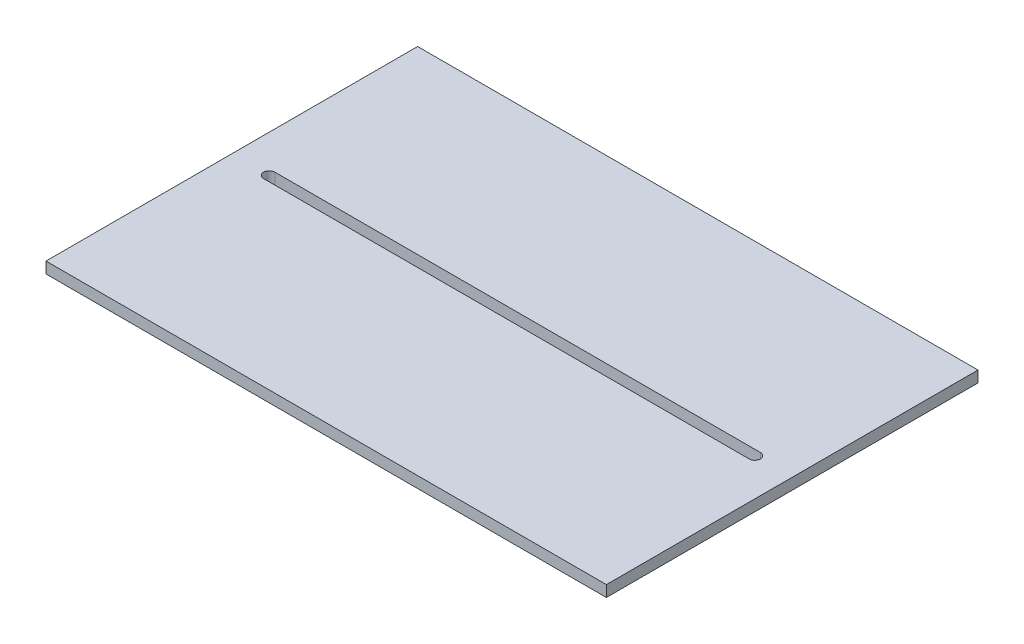
ISO-10303-21;
HEADER;
FILE_DESCRIPTION(('STEP AP214'),'2;1');
FILE_NAME('part.step','',(''),(''),'','','');
FILE_SCHEMA(('AUTOMOTIVE_DESIGN { 1 0 10303 214 1 1 1 1 }'));
ENDSEC;
DATA;
#1=APPLICATION_CONTEXT('core data for automotive mechanical design processes');
#2=APPLICATION_PROTOCOL_DEFINITION('international standard','automotive_design',2000,#1);
#3=PRODUCT_CONTEXT('',#1,'mechanical');
#4=PRODUCT('Part','Part','',(#3));
#5=PRODUCT_RELATED_PRODUCT_CATEGORY('part','',(#4));
#6=PRODUCT_DEFINITION_FORMATION('','',#4);
#7=PRODUCT_DEFINITION_CONTEXT('part definition',#1,'design');
#8=PRODUCT_DEFINITION('design','',#6,#7);
#9=PRODUCT_DEFINITION_SHAPE('','',#8);
#10=(LENGTH_UNIT() NAMED_UNIT(*) SI_UNIT(.MILLI.,.METRE.));
#11=(NAMED_UNIT(*) PLANE_ANGLE_UNIT() SI_UNIT($,.RADIAN.));
#12=(NAMED_UNIT(*) SI_UNIT($,.STERADIAN.) SOLID_ANGLE_UNIT());
#13=UNCERTAINTY_MEASURE_WITH_UNIT(LENGTH_MEASURE(1.E-05),#10,'distance_accuracy_value','');
#14=(GEOMETRIC_REPRESENTATION_CONTEXT(3) GLOBAL_UNCERTAINTY_ASSIGNED_CONTEXT((#13)) GLOBAL_UNIT_ASSIGNED_CONTEXT((#10,
#11,#12)) REPRESENTATION_CONTEXT('',''));
#15=CARTESIAN_POINT('',(0.,0.,0.));
#16=DIRECTION('',(0.,0.,1.));
#17=DIRECTION('',(1.,0.,0.));
#18=AXIS2_PLACEMENT_3D('',#15,#16,#17);
#19=CARTESIAN_POINT('',(0.,3.,0.));
#20=DIRECTION('',(0.,-1.,0.));
#21=DIRECTION('',(0.,0.,-1.));
#22=AXIS2_PLACEMENT_3D('',#19,#20,#21);
#23=PLANE('',#22);
#24=DIRECTION('',(0.,0.,1.));
#25=VECTOR('',#24,1.);
#26=CARTESIAN_POINT('',(0.,3.,0.));
#27=LINE('',#26,#25);
#28=CARTESIAN_POINT('',(0.,3.,-99.4770586833956));
#29=VERTEX_POINT('',#28);
#30=CARTESIAN_POINT('',(0.,3.,0.));
#31=VERTEX_POINT('',#30);
#32=EDGE_CURVE('E134',#29,#31,#27,.T.);
#33=ORIENTED_EDGE('',*,*,#32,.T.);
#34=DIRECTION('',(1.,0.,0.));
#35=VECTOR('',#34,1.);
#36=CARTESIAN_POINT('',(0.,3.,0.));
#37=LINE('',#36,#35);
#38=CARTESIAN_POINT('',(150.,3.,0.));
#39=VERTEX_POINT('',#38);
#40=EDGE_CURVE('E137',#31,#39,#37,.T.);
#41=ORIENTED_EDGE('',*,*,#40,.T.);
#42=DIRECTION('',(0.,0.,-1.));
#43=VECTOR('',#42,1.);
#44=CARTESIAN_POINT('',(150.,3.,0.));
#45=LINE('',#44,#43);
#46=CARTESIAN_POINT('',(150.,3.,-99.4770586833956));
#47=VERTEX_POINT('',#46);
#48=EDGE_CURVE('E140',#39,#47,#45,.T.);
#49=ORIENTED_EDGE('',*,*,#48,.T.);
#50=DIRECTION('',(-1.,0.,0.));
#51=VECTOR('',#50,1.);
#52=CARTESIAN_POINT('',(0.,3.,-99.4770586833956));
#53=LINE('',#52,#51);
#54=EDGE_CURVE('E142',#47,#29,#53,.T.);
#55=ORIENTED_EDGE('',*,*,#54,.T.);
#56=EDGE_LOOP('',(#33,#41,#49,#55));
#57=FACE_BOUND('',#56,.T.);
#58=CARTESIAN_POINT('',(140.,3.,-49.7385293416978));
#59=DIRECTION('',(0.,1.,0.));
#60=DIRECTION('',(0.,0.,1.));
#61=AXIS2_PLACEMENT_3D('',#58,#59,#60);
#62=CIRCLE('',#61,1.50000000000001);
#63=CARTESIAN_POINT('',(140.,3.,-48.2385293416978));
#64=VERTEX_POINT('',#63);
#65=CARTESIAN_POINT('',(140.,3.,-51.2385293416978));
#66=VERTEX_POINT('',#65);
#67=EDGE_CURVE('E98',#64,#66,#62,.T.);
#68=ORIENTED_EDGE('',*,*,#67,.F.);
#69=DIRECTION('',(1.,0.,0.));
#70=VECTOR('',#69,1.);
#71=CARTESIAN_POINT('',(140.,3.,-48.2385293416978));
#72=LINE('',#71,#70);
#73=CARTESIAN_POINT('',(10.,3.,-48.2385293416978));
#74=VERTEX_POINT('',#73);
#75=EDGE_CURVE('E120',#74,#64,#72,.T.);
#76=ORIENTED_EDGE('',*,*,#75,.F.);
#77=CARTESIAN_POINT('',(10.,3.,-49.7385293416978));
#78=DIRECTION('',(0.,1.,0.));
#79=DIRECTION('',(0.,0.,1.));
#80=AXIS2_PLACEMENT_3D('',#77,#78,#79);
#81=CIRCLE('',#80,1.50000000000001);
#82=CARTESIAN_POINT('',(10.,3.,-51.2385293416978));
#83=VERTEX_POINT('',#82);
#84=EDGE_CURVE('E118',#83,#74,#81,.T.);
#85=ORIENTED_EDGE('',*,*,#84,.F.);
#86=DIRECTION('',(-1.,0.,0.));
#87=VECTOR('',#86,1.);
#88=CARTESIAN_POINT('',(140.,3.,-51.2385293416978));
#89=LINE('',#88,#87);
#90=EDGE_CURVE('E106',#66,#83,#89,.T.);
#91=ORIENTED_EDGE('',*,*,#90,.F.);
#92=EDGE_LOOP('',(#68,#76,#85,#91));
#93=FACE_BOUND('',#92,.T.);
#94=ADVANCED_FACE('F33',(#57,#93),#23,.F.);
#95=CARTESIAN_POINT('',(0.,0.,0.));
#96=DIRECTION('',(0.,-1.,0.));
#97=DIRECTION('',(0.,0.,-1.));
#98=AXIS2_PLACEMENT_3D('',#95,#96,#97);
#99=PLANE('',#98);
#100=DIRECTION('',(0.,0.,1.));
#101=VECTOR('',#100,1.);
#102=CARTESIAN_POINT('',(0.,0.,0.));
#103=LINE('',#102,#101);
#104=CARTESIAN_POINT('',(0.,0.,-99.4770586833956));
#105=VERTEX_POINT('',#104);
#106=CARTESIAN_POINT('',(0.,0.,0.));
#107=VERTEX_POINT('',#106);
#108=EDGE_CURVE('E114',#105,#107,#103,.T.);
#109=ORIENTED_EDGE('',*,*,#108,.F.);
#110=DIRECTION('',(-1.,0.,0.));
#111=VECTOR('',#110,1.);
#112=CARTESIAN_POINT('',(0.,0.,-99.4770586833956));
#113=LINE('',#112,#111);
#114=CARTESIAN_POINT('',(150.,0.,-99.4770586833956));
#115=VERTEX_POINT('',#114);
#116=EDGE_CURVE('E138',#115,#105,#113,.T.);
#117=ORIENTED_EDGE('',*,*,#116,.F.);
#118=DIRECTION('',(0.,0.,-1.));
#119=VECTOR('',#118,1.);
#120=CARTESIAN_POINT('',(150.,0.,0.));
#121=LINE('',#120,#119);
#122=CARTESIAN_POINT('',(150.,0.,0.));
#123=VERTEX_POINT('',#122);
#124=EDGE_CURVE('E149',#123,#115,#121,.T.);
#125=ORIENTED_EDGE('',*,*,#124,.F.);
#126=DIRECTION('',(1.,0.,0.));
#127=VECTOR('',#126,1.);
#128=CARTESIAN_POINT('',(0.,0.,0.));
#129=LINE('',#128,#127);
#130=EDGE_CURVE('E147',#107,#123,#129,.T.);
#131=ORIENTED_EDGE('',*,*,#130,.F.);
#132=EDGE_LOOP('',(#109,#117,#125,#131));
#133=FACE_BOUND('',#132,.T.);
#134=DIRECTION('',(1.,0.,0.));
#135=VECTOR('',#134,1.);
#136=CARTESIAN_POINT('',(140.,0.,-48.2385293416978));
#137=LINE('',#136,#135);
#138=CARTESIAN_POINT('',(10.,0.,-48.2385293416978));
#139=VERTEX_POINT('',#138);
#140=CARTESIAN_POINT('',(140.,0.,-48.2385293416978));
#141=VERTEX_POINT('',#140);
#142=EDGE_CURVE('E107',#139,#141,#137,.T.);
#143=ORIENTED_EDGE('',*,*,#142,.T.);
#144=CARTESIAN_POINT('',(140.,0.,-49.7385293416978));
#145=DIRECTION('',(0.,1.,0.));
#146=DIRECTION('',(0.,0.,1.));
#147=AXIS2_PLACEMENT_3D('',#144,#145,#146);
#148=CIRCLE('',#147,1.50000000000001);
#149=CARTESIAN_POINT('',(140.,0.,-51.2385293416978));
#150=VERTEX_POINT('',#149);
#151=EDGE_CURVE('E56',#141,#150,#148,.T.);
#152=ORIENTED_EDGE('',*,*,#151,.T.);
#153=DIRECTION('',(-1.,0.,0.));
#154=VECTOR('',#153,1.);
#155=CARTESIAN_POINT('',(140.,0.,-51.2385293416978));
#156=LINE('',#155,#154);
#157=CARTESIAN_POINT('',(10.,0.,-51.2385293416978));
#158=VERTEX_POINT('',#157);
#159=EDGE_CURVE('E113',#150,#158,#156,.T.);
#160=ORIENTED_EDGE('',*,*,#159,.T.);
#161=CARTESIAN_POINT('',(10.,0.,-49.7385293416978));
#162=DIRECTION('',(0.,1.,0.));
#163=DIRECTION('',(0.,0.,1.));
#164=AXIS2_PLACEMENT_3D('',#161,#162,#163);
#165=CIRCLE('',#164,1.50000000000001);
#166=EDGE_CURVE('E126',#158,#139,#165,.T.);
#167=ORIENTED_EDGE('',*,*,#166,.T.);
#168=EDGE_LOOP('',(#143,#152,#160,#167));
#169=FACE_BOUND('',#168,.T.);
#170=ADVANCED_FACE('F167',(#133,#169),#99,.T.);
#171=CARTESIAN_POINT('',(0.,3.,0.));
#172=DIRECTION('',(1.,0.,0.));
#173=DIRECTION('',(0.,0.,-1.));
#174=AXIS2_PLACEMENT_3D('',#171,#172,#173);
#175=PLANE('',#174);
#176=ORIENTED_EDGE('',*,*,#108,.T.);
#177=DIRECTION('',(0.,-1.,0.));
#178=VECTOR('',#177,1.);
#179=CARTESIAN_POINT('',(0.,3.,0.));
#180=LINE('',#179,#178);
#181=EDGE_CURVE('E11',#31,#107,#180,.T.);
#182=ORIENTED_EDGE('',*,*,#181,.F.);
#183=ORIENTED_EDGE('',*,*,#32,.F.);
#184=DIRECTION('',(0.,-1.,0.));
#185=VECTOR('',#184,1.);
#186=CARTESIAN_POINT('',(0.,3.,-99.4770586833956));
#187=LINE('',#186,#185);
#188=EDGE_CURVE('E144',#29,#105,#187,.T.);
#189=ORIENTED_EDGE('',*,*,#188,.T.);
#190=EDGE_LOOP('',(#176,#182,#183,#189));
#191=FACE_BOUND('',#190,.T.);
#192=ADVANCED_FACE('F35',(#191),#175,.F.);
#193=CARTESIAN_POINT('',(0.,3.,0.));
#194=DIRECTION('',(0.,0.,-1.));
#195=DIRECTION('',(-1.,0.,0.));
#196=AXIS2_PLACEMENT_3D('',#193,#194,#195);
#197=PLANE('',#196);
#198=ORIENTED_EDGE('',*,*,#130,.T.);
#199=DIRECTION('',(0.,-1.,0.));
#200=VECTOR('',#199,1.);
#201=CARTESIAN_POINT('',(150.,3.,0.));
#202=LINE('',#201,#200);
#203=EDGE_CURVE('E41',#39,#123,#202,.T.);
#204=ORIENTED_EDGE('',*,*,#203,.F.);
#205=ORIENTED_EDGE('',*,*,#40,.F.);
#206=ORIENTED_EDGE('',*,*,#181,.T.);
#207=EDGE_LOOP('',(#198,#204,#205,#206));
#208=FACE_BOUND('',#207,.T.);
#209=ADVANCED_FACE('F177',(#208),#197,.F.);
#210=CARTESIAN_POINT('',(150.,3.,0.));
#211=DIRECTION('',(-1.,0.,0.));
#212=DIRECTION('',(0.,0.,1.));
#213=AXIS2_PLACEMENT_3D('',#210,#211,#212);
#214=PLANE('',#213);
#215=ORIENTED_EDGE('',*,*,#124,.T.);
#216=DIRECTION('',(0.,-1.,0.));
#217=VECTOR('',#216,1.);
#218=CARTESIAN_POINT('',(150.,3.,-99.4770586833956));
#219=LINE('',#218,#217);
#220=EDGE_CURVE('E154',#47,#115,#219,.T.);
#221=ORIENTED_EDGE('',*,*,#220,.F.);
#222=ORIENTED_EDGE('',*,*,#48,.F.);
#223=ORIENTED_EDGE('',*,*,#203,.T.);
#224=EDGE_LOOP('',(#215,#221,#222,#223));
#225=FACE_BOUND('',#224,.T.);
#226=ADVANCED_FACE('F161',(#225),#214,.F.);
#227=CARTESIAN_POINT('',(0.,3.,-99.4770586833956));
#228=DIRECTION('',(0.,0.,1.));
#229=DIRECTION('',(1.,0.,0.));
#230=AXIS2_PLACEMENT_3D('',#227,#228,#229);
#231=PLANE('',#230);
#232=ORIENTED_EDGE('',*,*,#116,.T.);
#233=ORIENTED_EDGE('',*,*,#188,.F.);
#234=ORIENTED_EDGE('',*,*,#54,.F.);
#235=ORIENTED_EDGE('',*,*,#220,.T.);
#236=EDGE_LOOP('',(#232,#233,#234,#235));
#237=FACE_BOUND('',#236,.T.);
#238=ADVANCED_FACE('F171',(#237),#231,.F.);
#239=CARTESIAN_POINT('',(140.,3.,-49.7385293416978));
#240=DIRECTION('',(0.,-1.,0.));
#241=DIRECTION('',(0.,0.,-1.));
#242=AXIS2_PLACEMENT_3D('',#239,#240,#241);
#243=CYLINDRICAL_SURFACE('',#242,1.50000000000001);
#244=ORIENTED_EDGE('',*,*,#151,.F.);
#245=DIRECTION('',(0.,-1.,0.));
#246=VECTOR('',#245,1.);
#247=CARTESIAN_POINT('',(140.,3.,-48.2385293416978));
#248=LINE('',#247,#246);
#249=EDGE_CURVE('E102',#64,#141,#248,.T.);
#250=ORIENTED_EDGE('',*,*,#249,.F.);
#251=ORIENTED_EDGE('',*,*,#67,.T.);
#252=DIRECTION('',(0.,-1.,0.));
#253=VECTOR('',#252,1.);
#254=CARTESIAN_POINT('',(140.,3.,-51.2385293416978));
#255=LINE('',#254,#253);
#256=EDGE_CURVE('E101',#66,#150,#255,.T.);
#257=ORIENTED_EDGE('',*,*,#256,.T.);
#258=EDGE_LOOP('',(#244,#250,#251,#257));
#259=FACE_BOUND('',#258,.T.);
#260=ADVANCED_FACE('F100',(#259),#243,.F.);
#261=CARTESIAN_POINT('',(140.,3.,-51.2385293416978));
#262=DIRECTION('',(0.,0.,1.));
#263=DIRECTION('',(1.,0.,0.));
#264=AXIS2_PLACEMENT_3D('',#261,#262,#263);
#265=PLANE('',#264);
#266=ORIENTED_EDGE('',*,*,#159,.F.);
#267=ORIENTED_EDGE('',*,*,#256,.F.);
#268=ORIENTED_EDGE('',*,*,#90,.T.);
#269=DIRECTION('',(0.,-1.,0.));
#270=VECTOR('',#269,1.);
#271=CARTESIAN_POINT('',(10.,3.,-51.2385293416978));
#272=LINE('',#271,#270);
#273=EDGE_CURVE('E115',#83,#158,#272,.T.);
#274=ORIENTED_EDGE('',*,*,#273,.T.);
#275=EDGE_LOOP('',(#266,#267,#268,#274));
#276=FACE_BOUND('',#275,.T.);
#277=ADVANCED_FACE('F110',(#276),#265,.T.);
#278=CARTESIAN_POINT('',(10.,3.,-49.7385293416978));
#279=DIRECTION('',(0.,-1.,0.));
#280=DIRECTION('',(0.,0.,-1.));
#281=AXIS2_PLACEMENT_3D('',#278,#279,#280);
#282=CYLINDRICAL_SURFACE('',#281,1.50000000000001);
#283=ORIENTED_EDGE('',*,*,#166,.F.);
#284=ORIENTED_EDGE('',*,*,#273,.F.);
#285=ORIENTED_EDGE('',*,*,#84,.T.);
#286=DIRECTION('',(0.,-1.,0.));
#287=VECTOR('',#286,1.);
#288=CARTESIAN_POINT('',(10.,3.,-48.2385293416978));
#289=LINE('',#288,#287);
#290=EDGE_CURVE('E48',#74,#139,#289,.T.);
#291=ORIENTED_EDGE('',*,*,#290,.T.);
#292=EDGE_LOOP('',(#283,#284,#285,#291));
#293=FACE_BOUND('',#292,.T.);
#294=ADVANCED_FACE('F200',(#293),#282,.F.);
#295=CARTESIAN_POINT('',(140.,3.,-48.2385293416978));
#296=DIRECTION('',(0.,0.,-1.));
#297=DIRECTION('',(-1.,0.,0.));
#298=AXIS2_PLACEMENT_3D('',#295,#296,#297);
#299=PLANE('',#298);
#300=ORIENTED_EDGE('',*,*,#142,.F.);
#301=ORIENTED_EDGE('',*,*,#290,.F.);
#302=ORIENTED_EDGE('',*,*,#75,.T.);
#303=ORIENTED_EDGE('',*,*,#249,.T.);
#304=EDGE_LOOP('',(#300,#301,#302,#303));
#305=FACE_BOUND('',#304,.T.);
#306=ADVANCED_FACE('F204',(#305),#299,.T.);
#307=CLOSED_SHELL('',(#94,#170,#192,#209,#226,#238,#260,#277,#294,#306));
#308=MANIFOLD_SOLID_BREP('B2',#307);
#309=ADVANCED_BREP_SHAPE_REPRESENTATION('',(#18,#308),#14);
#310=SHAPE_DEFINITION_REPRESENTATION(#9,#309);
ENDSEC;
END-ISO-10303-21;
